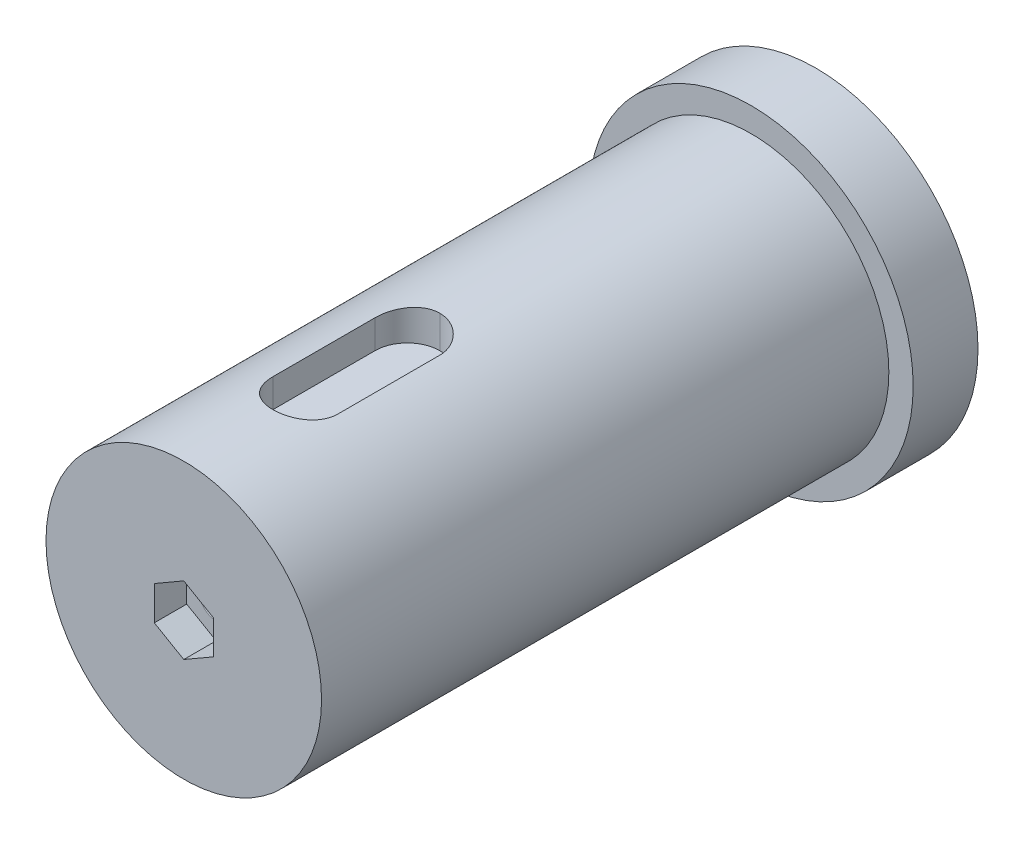
ISO-10303-21;
HEADER;
FILE_DESCRIPTION(('STEP AP214'),'2;1');
FILE_NAME('part.step','',(''),(''),'','','');
FILE_SCHEMA(('AUTOMOTIVE_DESIGN { 1 0 10303 214 1 1 1 1 }'));
ENDSEC;
DATA;
#1=APPLICATION_CONTEXT('core data for automotive mechanical design processes');
#2=APPLICATION_PROTOCOL_DEFINITION('international standard','automotive_design',2000,#1);
#3=PRODUCT_CONTEXT('',#1,'mechanical');
#4=PRODUCT('Part','Part','',(#3));
#5=PRODUCT_RELATED_PRODUCT_CATEGORY('part','',(#4));
#6=PRODUCT_DEFINITION_FORMATION('','',#4);
#7=PRODUCT_DEFINITION_CONTEXT('part definition',#1,'design');
#8=PRODUCT_DEFINITION('design','',#6,#7);
#9=PRODUCT_DEFINITION_SHAPE('','',#8);
#10=(LENGTH_UNIT() NAMED_UNIT(*) SI_UNIT(.MILLI.,.METRE.));
#11=(NAMED_UNIT(*) PLANE_ANGLE_UNIT() SI_UNIT($,.RADIAN.));
#12=(NAMED_UNIT(*) SI_UNIT($,.STERADIAN.) SOLID_ANGLE_UNIT());
#13=UNCERTAINTY_MEASURE_WITH_UNIT(LENGTH_MEASURE(1.E-05),#10,'distance_accuracy_value','');
#14=(GEOMETRIC_REPRESENTATION_CONTEXT(3) GLOBAL_UNCERTAINTY_ASSIGNED_CONTEXT((#13)) GLOBAL_UNIT_ASSIGNED_CONTEXT((#10,
#11,#12)) REPRESENTATION_CONTEXT('',''));
#15=CARTESIAN_POINT('',(0.,0.,0.));
#16=DIRECTION('',(0.,0.,1.));
#17=DIRECTION('',(1.,0.,0.));
#18=AXIS2_PLACEMENT_3D('',#15,#16,#17);
#19=CARTESIAN_POINT('',(0.,0.,35.));
#20=DIRECTION('',(0.,0.,-1.));
#21=DIRECTION('',(-1.,0.,0.));
#22=AXIS2_PLACEMENT_3D('',#19,#20,#21);
#23=CYLINDRICAL_SURFACE('',#22,8.5);
#24=CARTESIAN_POINT('',(-2.,8.26135582092915,31.5));
#25=CARTESIAN_POINT('',(-2.00000055504916,8.26135236320292,31.5554344323461));
#26=CARTESIAN_POINT('',(-1.99769380139236,8.2619144856103,31.6108415088054));
#27=CARTESIAN_POINT('',(-1.98849731170137,8.264134056541,31.7212434339865));
#28=CARTESIAN_POINT('',(-1.98160828133565,8.26579133641032,31.7762383448629));
#29=CARTESIAN_POINT('',(-1.95416393612277,8.27234056234883,31.9397976249519));
#30=CARTESIAN_POINT('',(-1.92683096321235,8.27881027991498,32.0472414713627));
#31=CARTESIAN_POINT('',(-1.85496116677948,8.29520698466521,32.2558503459617));
#32=CARTESIAN_POINT('',(-1.81042483664592,8.30513387269752,32.3570155541235));
#33=CARTESIAN_POINT('',(-1.70546046419011,8.32732086336626,32.5504829517604));
#34=CARTESIAN_POINT('',(-1.6450289846229,8.33958147049888,32.6427832183367));
#35=CARTESIAN_POINT('',(-1.50874637759438,8.36531906602219,32.8176445304476));
#36=CARTESIAN_POINT('',(-1.43264491321001,8.37881352706603,32.9000078464186));
#37=CARTESIAN_POINT('',(-1.26771483694585,8.40534737590744,33.0509339049674));
#38=CARTESIAN_POINT('',(-1.17888421755235,8.41838669151993,33.1194944666046));
#39=CARTESIAN_POINT('',(-0.989672002747235,8.442733227235,33.2416609494937));
#40=CARTESIAN_POINT('',(-0.889162184224323,8.45401726068056,33.2950732925612));
#41=CARTESIAN_POINT('',(-0.68028730939155,8.47338148505523,33.3841696035676));
#42=CARTESIAN_POINT('',(-0.571923680419551,8.48146225642124,33.4198567836348));
#43=CARTESIAN_POINT('',(-0.352485313548645,8.49338596556868,33.4718616310578));
#44=CARTESIAN_POINT('',(-0.241494636223676,8.49730265616028,33.4885167992637));
#45=CARTESIAN_POINT('',(-0.0182275662118472,8.50071323920615,33.5030423420087));
#46=CARTESIAN_POINT('',(0.0940486848647822,8.50020761420044,33.5009147660224));
#47=CARTESIAN_POINT('',(0.314360678706197,8.49488597842209,33.4781814254168));
#48=CARTESIAN_POINT('',(0.422436389839879,8.490154991221,33.4579401327781));
#49=CARTESIAN_POINT('',(0.633611361576777,8.47701221926345,33.4001375163765));
#50=CARTESIAN_POINT('',(0.736710417304357,8.46860028311537,33.3625754802352));
#51=CARTESIAN_POINT('',(0.935993037737944,8.44890733460507,33.2708889810726));
#52=CARTESIAN_POINT('',(1.03211256730711,8.43760323594277,33.2166304990674));
#53=CARTESIAN_POINT('',(1.21400998738322,8.41335915429893,33.0931932832842));
#54=CARTESIAN_POINT('',(1.29978653304345,8.40041895903104,33.0240126125025));
#55=CARTESIAN_POINT('',(1.46072775473717,8.37395331213205,32.870735689924));
#56=CARTESIAN_POINT('',(1.53558950612902,8.36042126513727,32.7863222321905));
#57=CARTESIAN_POINT('',(1.67017505039282,8.33458019092887,32.6059723999822));
#58=CARTESIAN_POINT('',(1.72989470920645,8.32227149826905,32.5100328892058));
#59=CARTESIAN_POINT('',(1.8326691841855,8.30024752435885,32.3087960773831));
#60=CARTESIAN_POINT('',(1.87564929064842,8.29054392828406,32.2034593464437));
#61=CARTESIAN_POINT('',(1.94314531697339,8.27498678101182,31.9868380328643));
#62=CARTESIAN_POINT('',(1.96768876833644,8.26912749076621,31.8755625857552));
#63=CARTESIAN_POINT('',(1.9884132926376,8.26415363873449,31.7194550079354));
#64=CARTESIAN_POINT('',(1.99275932156623,8.26310592036969,31.6756461268753));
#65=CARTESIAN_POINT('',(1.99854927861069,8.2617074132624,31.5878983269988));
#66=CARTESIAN_POINT('',(1.99999797058451,8.26135548050657,31.5439597408004));
#67=CARTESIAN_POINT('',(2.,8.26135582092915,31.5));
#68=B_SPLINE_CURVE_WITH_KNOTS('',3,(#24,#25,#26,#27,#28,#29,#30,#31,#32,#33,#34,#35,#36,#37,#38,
#39,#40,#41,#42,#43,#44,#45,#46,#47,#48,#49,#50,#51,#52,#53,#54,#55,#56,#57,#58,#59,#60,#61,#62,
#63,#64,#65,#66,#67),.UNSPECIFIED.,.F.,.F.,(4,2,2,2,2,2,2,2,2,2,2,2,2,2,2,2,2,2,2,2,2,4),(0.,
0.166198597648887,0.332371606715104,0.663814743733813,0.99524837573467,1.32675373757507,
1.66403554066599,2.00137059509772,2.34283993997873,2.6842473816804,3.01950170621967,
3.35471945001223,3.68334015893414,4.01197438477704,4.34331851400086,4.67470567990143,
5.0140198579258,5.35342657519617,5.69433118783423,6.03472570922611,6.16675483550179,
6.29856669785088),.UNSPECIFIED.);
#69=CARTESIAN_POINT('',(-2.,8.26135582092915,31.5));
#70=VERTEX_POINT('',#69);
#71=CARTESIAN_POINT('',(2.,8.26135582092915,31.5));
#72=VERTEX_POINT('',#71);
#73=EDGE_CURVE('E280',#70,#72,#68,.T.);
#74=ORIENTED_EDGE('',*,*,#73,.F.);
#75=DIRECTION('',(0.,0.,-1.));
#76=VECTOR('',#75,1.);
#77=CARTESIAN_POINT('',(-2.,8.26135582092915,35.));
#78=LINE('',#77,#76);
#79=CARTESIAN_POINT('',(-2.,8.26135582092915,25.2));
#80=VERTEX_POINT('',#79);
#81=EDGE_CURVE('E274',#70,#80,#78,.T.);
#82=ORIENTED_EDGE('',*,*,#81,.T.);
#83=CARTESIAN_POINT('',(-2.,8.26135582092915,25.2));
#84=CARTESIAN_POINT('',(-2.00000055481078,8.26135236234096,25.1445638146387));
#85=CARTESIAN_POINT('',(-1.99769365512001,8.26191452081548,25.0891549847846));
#86=CARTESIAN_POINT('',(-1.98849658529978,8.26413423183047,24.9787495974245));
#87=CARTESIAN_POINT('',(-1.98160712139145,8.26579161558501,24.9237529777129));
#88=CARTESIAN_POINT('',(-1.95416220490535,8.27234097037779,24.7601955672022));
#89=CARTESIAN_POINT('',(-1.92682981263254,8.27881053946126,24.6527552249935));
#90=CARTESIAN_POINT('',(-1.85496170194013,8.29520686552344,24.4441511713702));
#91=CARTESIAN_POINT('',(-1.81042618226286,8.30513358256267,24.3429873874602));
#92=CARTESIAN_POINT('',(-1.70546216079269,8.32732051039671,24.1495197141093));
#93=CARTESIAN_POINT('',(-1.64502976293738,8.33958129302866,24.0572180041965));
#94=CARTESIAN_POINT('',(-1.508747644908,8.36531885769638,23.8823568678266));
#95=CARTESIAN_POINT('',(-1.43264803442737,8.37881308162502,23.7999948297994));
#96=CARTESIAN_POINT('',(-1.26771685263656,8.40534699516044,23.6490681196295));
#97=CARTESIAN_POINT('',(-1.17888287862265,8.41838659841144,23.5805060571313));
#98=CARTESIAN_POINT('',(-0.989647688172531,8.44273662458629,23.4583219459734));
#99=CARTESIAN_POINT('',(-0.889115492968539,8.45402333624081,23.4048978390107));
#100=CARTESIAN_POINT('',(-0.68021441176007,8.47338649943353,23.3158082505194));
#101=CARTESIAN_POINT('',(-0.571851471709626,8.4814653570701,23.2801294537652));
#102=CARTESIAN_POINT('',(-0.385749950023949,8.49157901314195,23.2360194929617));
#103=CARTESIAN_POINT('',(-0.309231901074022,8.49471887929121,23.2225314472355));
#104=CARTESIAN_POINT('',(-0.155155681588706,8.49893711548355,23.2045169857729));
#105=CARTESIAN_POINT('',(-0.0775983952096995,8.5000171381747,23.1999833856257));
#106=CARTESIAN_POINT('',(0.,8.5,23.2));
#107=B_SPLINE_CURVE_WITH_KNOTS('',3,(#83,#84,#85,#86,#87,#88,#89,#90,#91,#92,#93,#94,#95,#96,
#97,#98,#99,#100,#101,#102,#103,#104,#105,#106),.UNSPECIFIED.,.F.,.F.,(4,2,2,2,2,2,2,2,2,2,2,4),
(0.,0.166203852750406,0.332382097679765,0.663814771788094,0.995243617072994,1.32675376589839,
1.66403033417994,2.00137062334601,2.3429373614306,2.68424741616902,2.91701209762429,
3.14958994925359),.UNSPECIFIED.);
#108=CARTESIAN_POINT('',(0.,8.5,23.2));
#109=VERTEX_POINT('',#108);
#110=EDGE_CURVE('E601',#80,#109,#107,.T.);
#111=ORIENTED_EDGE('',*,*,#110,.T.);
#112=CARTESIAN_POINT('',(0.,8.5,23.2));
#113=CARTESIAN_POINT('',(0.0554577177830956,8.50000298855883,23.1999995030463));
#114=CARTESIAN_POINT('',(0.110888151586279,8.49945658717442,23.202308140867));
#115=CARTESIAN_POINT('',(0.221337970644715,8.497296802984,23.2115125100492));
#116=CARTESIAN_POINT('',(0.276357413972367,8.49568357391788,23.2184075804637));
#117=CARTESIAN_POINT('',(0.439991395916461,8.48930268040551,23.245876782209));
#118=CARTESIAN_POINT('',(0.547487078088003,8.48299346551874,23.2732353043088));
#119=CARTESIAN_POINT('',(0.756204960649804,8.46694420606055,23.3451794369051));
#120=CARTESIAN_POINT('',(0.857426954224051,8.45720404845665,23.3897656149718));
#121=CARTESIAN_POINT('',(1.05099104224266,8.43533693314088,23.494848097553));
#122=CARTESIAN_POINT('',(1.14333121189809,8.42320945979847,23.5553478401506));
#123=CARTESIAN_POINT('',(1.3181501151451,8.3976440317271,23.6916990992848));
#124=CARTESIAN_POINT('',(1.40044305664729,8.38418790158618,23.767785312517));
#125=CARTESIAN_POINT('',(1.55123614971488,8.35760381501932,23.9326610461237));
#126=CARTESIAN_POINT('',(1.619733350118,8.34447592933583,24.0214532776148));
#127=CARTESIAN_POINT('',(1.74184693943837,8.31985060969153,24.2106490764957));
#128=CARTESIAN_POINT('',(1.79525416276162,8.30837708034302,24.3111908884767));
#129=CARTESIAN_POINT('',(1.88430913042451,8.28863511914758,24.5201109245299));
#130=CARTESIAN_POINT('',(1.91997068491663,8.28036419606278,24.6284829794391));
#131=CARTESIAN_POINT('',(1.96403435943009,8.27000058789428,24.8145375464282));
#132=CARTESIAN_POINT('',(1.97750168238921,8.26677902264792,24.8909955819783));
#133=CARTESIAN_POINT('',(1.99548948288383,8.26244785871754,25.0449557333138));
#134=CARTESIAN_POINT('',(2.00001672996872,8.26133666205758,25.1224570143309));
#135=CARTESIAN_POINT('',(2.,8.26135582092915,25.2));
#136=B_SPLINE_CURVE_WITH_KNOTS('',3,(#112,#113,#114,#115,#116,#117,#118,#119,#120,#121,#122,
#123,#124,#125,#126,#127,#128,#129,#130,#131,#132,#133,#134,#135),.UNSPECIFIED.,.F.,.F.,(4,2,2,
2,2,2,2,2,2,2,2,4),(0.,0.1662686484185,0.332513341183918,0.664098160325054,0.995693904556593,
1.32736134808833,1.66444828413272,2.00160725285015,2.34323295798394,2.6845923834696,
2.9171790790428,3.14958958910976),.UNSPECIFIED.);
#137=CARTESIAN_POINT('',(2.,8.26135582092915,25.2));
#138=VERTEX_POINT('',#137);
#139=EDGE_CURVE('E593',#109,#138,#136,.T.);
#140=ORIENTED_EDGE('',*,*,#139,.T.);
#141=DIRECTION('',(0.,0.,-1.));
#142=VECTOR('',#141,1.);
#143=CARTESIAN_POINT('',(2.,8.26135582092915,35.));
#144=LINE('',#143,#142);
#145=EDGE_CURVE('E278',#138,#72,#144,.F.);
#146=ORIENTED_EDGE('',*,*,#145,.T.);
#147=EDGE_LOOP('',(#74,#82,#111,#140,#146));
#148=FACE_BOUND('',#147,.T.);
#149=CARTESIAN_POINT('',(0.,0.,4.));
#150=DIRECTION('',(0.,0.,1.));
#151=DIRECTION('',(1.,0.,0.));
#152=AXIS2_PLACEMENT_3D('',#149,#150,#151);
#153=CIRCLE('',#152,8.5);
#154=CARTESIAN_POINT('',(8.5,0.,4.));
#155=VERTEX_POINT('',#154);
#156=EDGE_CURVE('E252',#155,#155,#153,.T.);
#157=ORIENTED_EDGE('',*,*,#156,.T.);
#158=EDGE_LOOP('',(#157));
#159=FACE_BOUND('',#158,.T.);
#160=CARTESIAN_POINT('',(0.,0.,39.));
#161=DIRECTION('',(0.,0.,1.));
#162=DIRECTION('',(1.,0.,0.));
#163=AXIS2_PLACEMENT_3D('',#160,#161,#162);
#164=CIRCLE('',#163,8.5);
#165=CARTESIAN_POINT('',(8.5,0.,39.));
#166=VERTEX_POINT('',#165);
#167=EDGE_CURVE('E240',#166,#166,#164,.T.);
#168=ORIENTED_EDGE('',*,*,#167,.F.);
#169=EDGE_LOOP('',(#168));
#170=FACE_BOUND('',#169,.T.);
#171=ADVANCED_FACE('F58',(#148,#159,#170),#23,.T.);
#172=CARTESIAN_POINT('',(-2.,6.5,21.));
#173=DIRECTION('',(0.,-1.,0.));
#174=DIRECTION('',(0.,0.,-1.));
#175=AXIS2_PLACEMENT_3D('',#172,#173,#174);
#176=PLANE('',#175);
#177=CARTESIAN_POINT('',(0.,6.5,25.2));
#178=DIRECTION('',(0.,-1.,0.));
#179=DIRECTION('',(0.,0.,-1.));
#180=AXIS2_PLACEMENT_3D('',#177,#178,#179);
#181=CIRCLE('',#180,2.);
#182=CARTESIAN_POINT('',(2.,6.5,25.2));
#183=VERTEX_POINT('',#182);
#184=CARTESIAN_POINT('',(0.,6.5,23.2));
#185=VERTEX_POINT('',#184);
#186=EDGE_CURVE('E289',#183,#185,#181,.F.);
#187=ORIENTED_EDGE('',*,*,#186,.T.);
#188=CARTESIAN_POINT('',(0.,6.5,25.2));
#189=DIRECTION('',(0.,-1.,0.));
#190=DIRECTION('',(0.,0.,-1.));
#191=AXIS2_PLACEMENT_3D('',#188,#189,#190);
#192=CIRCLE('',#191,2.);
#193=CARTESIAN_POINT('',(-2.,6.5,25.2));
#194=VERTEX_POINT('',#193);
#195=EDGE_CURVE('E619',#185,#194,#192,.F.);
#196=ORIENTED_EDGE('',*,*,#195,.T.);
#197=DIRECTION('',(0.,0.,1.));
#198=VECTOR('',#197,1.);
#199=CARTESIAN_POINT('',(-2.,6.5,21.));
#200=LINE('',#199,#198);
#201=CARTESIAN_POINT('',(-2.,6.5,31.5));
#202=VERTEX_POINT('',#201);
#203=EDGE_CURVE('E271',#194,#202,#200,.T.);
#204=ORIENTED_EDGE('',*,*,#203,.T.);
#205=CARTESIAN_POINT('',(0.,6.5,31.5));
#206=DIRECTION('',(0.,1.,0.));
#207=DIRECTION('',(0.,0.,1.));
#208=AXIS2_PLACEMENT_3D('',#205,#206,#207);
#209=CIRCLE('',#208,2.);
#210=CARTESIAN_POINT('',(2.,6.5,31.5));
#211=VERTEX_POINT('',#210);
#212=EDGE_CURVE('E259',#202,#211,#209,.T.);
#213=ORIENTED_EDGE('',*,*,#212,.T.);
#214=DIRECTION('',(0.,0.,1.));
#215=VECTOR('',#214,1.);
#216=CARTESIAN_POINT('',(2.,6.5,21.));
#217=LINE('',#216,#215);
#218=EDGE_CURVE('E272',#183,#211,#217,.T.);
#219=ORIENTED_EDGE('',*,*,#218,.F.);
#220=EDGE_LOOP('',(#187,#196,#204,#213,#219));
#221=FACE_BOUND('',#220,.T.);
#222=ADVANCED_FACE('F310',(#221),#176,.F.);
#223=CARTESIAN_POINT('',(2.,10.5,21.));
#224=DIRECTION('',(1.,0.,0.));
#225=DIRECTION('',(0.,1.,0.));
#226=AXIS2_PLACEMENT_3D('',#223,#224,#225);
#227=PLANE('',#226);
#228=ORIENTED_EDGE('',*,*,#145,.F.);
#229=DIRECTION('',(0.,-1.,0.));
#230=VECTOR('',#229,1.);
#231=CARTESIAN_POINT('',(2.,6.5,25.2));
#232=LINE('',#231,#230);
#233=EDGE_CURVE('E622',#138,#183,#232,.T.);
#234=ORIENTED_EDGE('',*,*,#233,.T.);
#235=ORIENTED_EDGE('',*,*,#218,.T.);
#236=DIRECTION('',(0.,-1.,0.));
#237=VECTOR('',#236,1.);
#238=CARTESIAN_POINT('',(2.,10.,31.5));
#239=LINE('',#238,#237);
#240=EDGE_CURVE('E262',#72,#211,#239,.T.);
#241=ORIENTED_EDGE('',*,*,#240,.F.);
#242=EDGE_LOOP('',(#228,#234,#235,#241));
#243=FACE_BOUND('',#242,.T.);
#244=ADVANCED_FACE('F313',(#243),#227,.F.);
#245=CARTESIAN_POINT('',(-2.,10.5,21.));
#246=DIRECTION('',(-1.,0.,0.));
#247=DIRECTION('',(0.,-1.,0.));
#248=AXIS2_PLACEMENT_3D('',#245,#246,#247);
#249=PLANE('',#248);
#250=ORIENTED_EDGE('',*,*,#203,.F.);
#251=DIRECTION('',(0.,-1.,0.));
#252=VECTOR('',#251,1.);
#253=CARTESIAN_POINT('',(-2.,8.26135582092915,25.2));
#254=LINE('',#253,#252);
#255=EDGE_CURVE('E629',#194,#80,#254,.F.);
#256=ORIENTED_EDGE('',*,*,#255,.T.);
#257=ORIENTED_EDGE('',*,*,#81,.F.);
#258=DIRECTION('',(0.,-1.,0.));
#259=VECTOR('',#258,1.);
#260=CARTESIAN_POINT('',(-2.,10.,31.5));
#261=LINE('',#260,#259);
#262=EDGE_CURVE('E265',#70,#202,#261,.T.);
#263=ORIENTED_EDGE('',*,*,#262,.T.);
#264=EDGE_LOOP('',(#250,#256,#257,#263));
#265=FACE_BOUND('',#264,.T.);
#266=ADVANCED_FACE('F300',(#265),#249,.F.);
#267=CARTESIAN_POINT('',(0.,10.,31.5));
#268=DIRECTION('',(0.,-1.,0.));
#269=DIRECTION('',(0.,0.,-1.));
#270=AXIS2_PLACEMENT_3D('',#267,#268,#269);
#271=CYLINDRICAL_SURFACE('',#270,2.);
#272=ORIENTED_EDGE('',*,*,#73,.T.);
#273=ORIENTED_EDGE('',*,*,#240,.T.);
#274=ORIENTED_EDGE('',*,*,#212,.F.);
#275=ORIENTED_EDGE('',*,*,#262,.F.);
#276=EDGE_LOOP('',(#272,#273,#274,#275));
#277=FACE_BOUND('',#276,.T.);
#278=ADVANCED_FACE('F294',(#277),#271,.F.);
#279=CARTESIAN_POINT('',(0.,10.5,25.2));
#280=DIRECTION('',(0.,1.,0.));
#281=DIRECTION('',(-1.,0.,0.));
#282=AXIS2_PLACEMENT_3D('',#279,#280,#281);
#283=CYLINDRICAL_SURFACE('',#282,2.);
#284=ORIENTED_EDGE('',*,*,#233,.F.);
#285=ORIENTED_EDGE('',*,*,#139,.F.);
#286=DIRECTION('',(0.,-1.,0.));
#287=VECTOR('',#286,1.);
#288=CARTESIAN_POINT('',(0.,8.26135582092915,23.2));
#289=LINE('',#288,#287);
#290=EDGE_CURVE('E258',#185,#109,#289,.F.);
#291=ORIENTED_EDGE('',*,*,#290,.F.);
#292=ORIENTED_EDGE('',*,*,#186,.F.);
#293=EDGE_LOOP('',(#284,#285,#291,#292));
#294=FACE_BOUND('',#293,.T.);
#295=ADVANCED_FACE('F299',(#294),#283,.F.);
#296=CARTESIAN_POINT('',(0.,10.001,25.2));
#297=DIRECTION('',(0.,1.,0.));
#298=DIRECTION('',(-1.,0.,0.));
#299=AXIS2_PLACEMENT_3D('',#296,#297,#298);
#300=CYLINDRICAL_SURFACE('',#299,2.);
#301=ORIENTED_EDGE('',*,*,#110,.F.);
#302=ORIENTED_EDGE('',*,*,#255,.F.);
#303=ORIENTED_EDGE('',*,*,#195,.F.);
#304=ORIENTED_EDGE('',*,*,#290,.T.);
#305=EDGE_LOOP('',(#301,#302,#303,#304));
#306=FACE_BOUND('',#305,.T.);
#307=ADVANCED_FACE('F327',(#306),#300,.F.);
#308=CARTESIAN_POINT('',(0.,0.,4.));
#309=DIRECTION('',(0.,0.,1.));
#310=DIRECTION('',(1.,0.,0.));
#311=AXIS2_PLACEMENT_3D('',#308,#309,#310);
#312=PLANE('',#311);
#313=ORIENTED_EDGE('',*,*,#156,.F.);
#314=EDGE_LOOP('',(#313));
#315=FACE_BOUND('',#314,.T.);
#316=CARTESIAN_POINT('',(0.,0.,4.));
#317=DIRECTION('',(0.,0.,1.));
#318=DIRECTION('',(1.,0.,0.));
#319=AXIS2_PLACEMENT_3D('',#316,#317,#318);
#320=CIRCLE('',#319,10.);
#321=CARTESIAN_POINT('',(10.,0.,4.));
#322=VERTEX_POINT('',#321);
#323=EDGE_CURVE('E255',#322,#322,#320,.T.);
#324=ORIENTED_EDGE('',*,*,#323,.T.);
#325=EDGE_LOOP('',(#324));
#326=FACE_BOUND('',#325,.T.);
#327=ADVANCED_FACE('F302',(#315,#326),#312,.T.);
#328=CARTESIAN_POINT('',(0.,0.,0.));
#329=DIRECTION('',(0.,0.,1.));
#330=DIRECTION('',(1.,0.,0.));
#331=AXIS2_PLACEMENT_3D('',#328,#329,#330);
#332=PLANE('',#331);
#333=DIRECTION('',(-1.,0.,0.));
#334=VECTOR('',#333,1.);
#335=CARTESIAN_POINT('',(-4.,-4.,0.));
#336=LINE('',#335,#334);
#337=CARTESIAN_POINT('',(4.,-4.,0.));
#338=VERTEX_POINT('',#337);
#339=CARTESIAN_POINT('',(-4.,-4.,0.));
#340=VERTEX_POINT('',#339);
#341=EDGE_CURVE('E194',#338,#340,#336,.T.);
#342=ORIENTED_EDGE('',*,*,#341,.F.);
#343=DIRECTION('',(0.,-1.,0.));
#344=VECTOR('',#343,1.);
#345=CARTESIAN_POINT('',(4.,-4.,0.));
#346=LINE('',#345,#344);
#347=CARTESIAN_POINT('',(4.,4.,0.));
#348=VERTEX_POINT('',#347);
#349=EDGE_CURVE('E73',#348,#338,#346,.T.);
#350=ORIENTED_EDGE('',*,*,#349,.F.);
#351=DIRECTION('',(1.,0.,0.));
#352=VECTOR('',#351,1.);
#353=CARTESIAN_POINT('',(-4.,4.,0.));
#354=LINE('',#353,#352);
#355=CARTESIAN_POINT('',(-4.,4.,0.));
#356=VERTEX_POINT('',#355);
#357=EDGE_CURVE('E185',#356,#348,#354,.T.);
#358=ORIENTED_EDGE('',*,*,#357,.F.);
#359=DIRECTION('',(0.,1.,0.));
#360=VECTOR('',#359,1.);
#361=CARTESIAN_POINT('',(-4.,-4.,0.));
#362=LINE('',#361,#360);
#363=EDGE_CURVE('E188',#340,#356,#362,.T.);
#364=ORIENTED_EDGE('',*,*,#363,.F.);
#365=EDGE_LOOP('',(#342,#350,#358,#364));
#366=FACE_BOUND('',#365,.T.);
#367=CARTESIAN_POINT('',(0.,0.,0.));
#368=DIRECTION('',(0.,0.,-1.));
#369=DIRECTION('',(-1.,0.,0.));
#370=AXIS2_PLACEMENT_3D('',#367,#368,#369);
#371=CIRCLE('',#370,10.);
#372=CARTESIAN_POINT('',(-10.,0.,0.));
#373=VERTEX_POINT('',#372);
#374=EDGE_CURVE('E268',#373,#373,#371,.T.);
#375=ORIENTED_EDGE('',*,*,#374,.T.);
#376=EDGE_LOOP('',(#375));
#377=FACE_BOUND('',#376,.T.);
#378=ADVANCED_FACE('F308',(#366,#377),#332,.F.);
#379=CARTESIAN_POINT('',(0.,0.,7.));
#380=DIRECTION('',(0.,0.,-1.));
#381=DIRECTION('',(-1.,0.,0.));
#382=AXIS2_PLACEMENT_3D('',#379,#380,#381);
#383=CYLINDRICAL_SURFACE('',#382,10.);
#384=ORIENTED_EDGE('',*,*,#374,.F.);
#385=EDGE_LOOP('',(#384));
#386=FACE_BOUND('',#385,.T.);
#387=ORIENTED_EDGE('',*,*,#323,.F.);
#388=EDGE_LOOP('',(#387));
#389=FACE_BOUND('',#388,.T.);
#390=ADVANCED_FACE('F304',(#386,#389),#383,.T.);
#391=CARTESIAN_POINT('',(0.,0.,39.));
#392=DIRECTION('',(0.,0.,1.));
#393=DIRECTION('',(1.,0.,0.));
#394=AXIS2_PLACEMENT_3D('',#391,#392,#393);
#395=PLANE('',#394);
#396=DIRECTION('',(-0.866025403784439,0.5,0.));
#397=VECTOR('',#396,1.);
#398=CARTESIAN_POINT('',(1.81865334794732,1.05,39.));
#399=LINE('',#398,#397);
#400=CARTESIAN_POINT('',(1.81865334794732,1.05,39.));
#401=VERTEX_POINT('',#400);
#402=CARTESIAN_POINT('',(0.,2.1,39.));
#403=VERTEX_POINT('',#402);
#404=EDGE_CURVE('E81',#401,#403,#399,.T.);
#405=ORIENTED_EDGE('',*,*,#404,.F.);
#406=DIRECTION('',(0.,1.,0.));
#407=VECTOR('',#406,1.);
#408=CARTESIAN_POINT('',(1.81865334794732,-1.05,39.));
#409=LINE('',#408,#407);
#410=CARTESIAN_POINT('',(1.81865334794732,-1.05,39.));
#411=VERTEX_POINT('',#410);
#412=EDGE_CURVE('E207',#411,#401,#409,.T.);
#413=ORIENTED_EDGE('',*,*,#412,.F.);
#414=DIRECTION('',(0.866025403784439,0.5,0.));
#415=VECTOR('',#414,1.);
#416=CARTESIAN_POINT('',(0.,-2.1,39.));
#417=LINE('',#416,#415);
#418=CARTESIAN_POINT('',(0.,-2.1,39.));
#419=VERTEX_POINT('',#418);
#420=EDGE_CURVE('E233',#419,#411,#417,.T.);
#421=ORIENTED_EDGE('',*,*,#420,.F.);
#422=DIRECTION('',(0.866025403784439,-0.5,0.));
#423=VECTOR('',#422,1.);
#424=CARTESIAN_POINT('',(-1.81865334794732,-1.05,39.));
#425=LINE('',#424,#423);
#426=CARTESIAN_POINT('',(-1.81865334794732,-1.05,39.));
#427=VERTEX_POINT('',#426);
#428=EDGE_CURVE('E230',#427,#419,#425,.T.);
#429=ORIENTED_EDGE('',*,*,#428,.F.);
#430=DIRECTION('',(0.,-1.,0.));
#431=VECTOR('',#430,1.);
#432=CARTESIAN_POINT('',(-1.81865334794732,1.05,39.));
#433=LINE('',#432,#431);
#434=CARTESIAN_POINT('',(-1.81865334794732,1.05,39.));
#435=VERTEX_POINT('',#434);
#436=EDGE_CURVE('E227',#435,#427,#433,.T.);
#437=ORIENTED_EDGE('',*,*,#436,.F.);
#438=DIRECTION('',(-0.866025403784438,-0.5,0.));
#439=VECTOR('',#438,1.);
#440=CARTESIAN_POINT('',(0.,2.1,39.));
#441=LINE('',#440,#439);
#442=EDGE_CURVE('E224',#403,#435,#441,.T.);
#443=ORIENTED_EDGE('',*,*,#442,.F.);
#444=EDGE_LOOP('',(#405,#413,#421,#429,#437,#443));
#445=FACE_BOUND('',#444,.T.);
#446=ORIENTED_EDGE('',*,*,#167,.T.);
#447=EDGE_LOOP('',(#446));
#448=FACE_BOUND('',#447,.T.);
#449=ADVANCED_FACE('F307',(#445,#448),#395,.T.);
#450=CARTESIAN_POINT('',(0.,0.,37.));
#451=DIRECTION('',(0.,0.,1.));
#452=DIRECTION('',(1.,0.,0.));
#453=AXIS2_PLACEMENT_3D('',#450,#451,#452);
#454=PLANE('',#453);
#455=CARTESIAN_POINT('',(0.,0.,37.));
#456=DIRECTION('',(0.,0.,1.));
#457=DIRECTION('',(1.,0.,0.));
#458=AXIS2_PLACEMENT_3D('',#455,#456,#457);
#459=CIRCLE('',#458,1.05);
#460=CARTESIAN_POINT('',(1.05,0.,37.));
#461=VERTEX_POINT('',#460);
#462=EDGE_CURVE('E12',#461,#461,#459,.F.);
#463=ORIENTED_EDGE('',*,*,#462,.T.);
#464=EDGE_LOOP('',(#463));
#465=FACE_BOUND('',#464,.T.);
#466=DIRECTION('',(-0.866025403784439,0.5,0.));
#467=VECTOR('',#466,1.);
#468=CARTESIAN_POINT('',(1.81865334794732,1.05,37.));
#469=LINE('',#468,#467);
#470=CARTESIAN_POINT('',(1.81865334794732,1.05,37.));
#471=VERTEX_POINT('',#470);
#472=CARTESIAN_POINT('',(0.,2.1,37.));
#473=VERTEX_POINT('',#472);
#474=EDGE_CURVE('E203',#471,#473,#469,.T.);
#475=ORIENTED_EDGE('',*,*,#474,.T.);
#476=DIRECTION('',(-0.866025403784438,-0.5,0.));
#477=VECTOR('',#476,1.);
#478=CARTESIAN_POINT('',(0.,2.1,37.));
#479=LINE('',#478,#477);
#480=CARTESIAN_POINT('',(-1.81865334794732,1.05,37.));
#481=VERTEX_POINT('',#480);
#482=EDGE_CURVE('E206',#473,#481,#479,.T.);
#483=ORIENTED_EDGE('',*,*,#482,.T.);
#484=DIRECTION('',(0.,-1.,0.));
#485=VECTOR('',#484,1.);
#486=CARTESIAN_POINT('',(-1.81865334794732,1.05,37.));
#487=LINE('',#486,#485);
#488=CARTESIAN_POINT('',(-1.81865334794732,-1.05,37.));
#489=VERTEX_POINT('',#488);
#490=EDGE_CURVE('E210',#481,#489,#487,.T.);
#491=ORIENTED_EDGE('',*,*,#490,.T.);
#492=DIRECTION('',(0.866025403784439,-0.5,0.));
#493=VECTOR('',#492,1.);
#494=CARTESIAN_POINT('',(-1.81865334794732,-1.05,37.));
#495=LINE('',#494,#493);
#496=CARTESIAN_POINT('',(0.,-2.1,37.));
#497=VERTEX_POINT('',#496);
#498=EDGE_CURVE('E213',#489,#497,#495,.T.);
#499=ORIENTED_EDGE('',*,*,#498,.T.);
#500=DIRECTION('',(0.866025403784439,0.5,0.));
#501=VECTOR('',#500,1.);
#502=CARTESIAN_POINT('',(0.,-2.1,37.));
#503=LINE('',#502,#501);
#504=CARTESIAN_POINT('',(1.81865334794732,-1.05,37.));
#505=VERTEX_POINT('',#504);
#506=EDGE_CURVE('E216',#497,#505,#503,.T.);
#507=ORIENTED_EDGE('',*,*,#506,.T.);
#508=DIRECTION('',(0.,1.,0.));
#509=VECTOR('',#508,1.);
#510=CARTESIAN_POINT('',(1.81865334794732,-1.05,37.));
#511=LINE('',#510,#509);
#512=EDGE_CURVE('E219',#505,#471,#511,.T.);
#513=ORIENTED_EDGE('',*,*,#512,.T.);
#514=EDGE_LOOP('',(#475,#483,#491,#499,#507,#513));
#515=FACE_BOUND('',#514,.T.);
#516=ADVANCED_FACE('F342',(#465,#515),#454,.T.);
#517=CARTESIAN_POINT('',(1.81865334794732,1.05,37.));
#518=DIRECTION('',(0.5,0.866025403784439,0.));
#519=DIRECTION('',(-0.866025403784439,0.5,0.));
#520=AXIS2_PLACEMENT_3D('',#517,#518,#519);
#521=PLANE('',#520);
#522=ORIENTED_EDGE('',*,*,#404,.T.);
#523=DIRECTION('',(0.,0.,1.));
#524=VECTOR('',#523,1.);
#525=CARTESIAN_POINT('',(0.,2.1,37.));
#526=LINE('',#525,#524);
#527=EDGE_CURVE('E222',#473,#403,#526,.T.);
#528=ORIENTED_EDGE('',*,*,#527,.F.);
#529=ORIENTED_EDGE('',*,*,#474,.F.);
#530=DIRECTION('',(0.,0.,1.));
#531=VECTOR('',#530,1.);
#532=CARTESIAN_POINT('',(1.81865334794732,1.05,37.));
#533=LINE('',#532,#531);
#534=EDGE_CURVE('E238',#471,#401,#533,.T.);
#535=ORIENTED_EDGE('',*,*,#534,.T.);
#536=EDGE_LOOP('',(#522,#528,#529,#535));
#537=FACE_BOUND('',#536,.T.);
#538=ADVANCED_FACE('F347',(#537),#521,.F.);
#539=CARTESIAN_POINT('',(1.81865334794732,-1.05,37.));
#540=DIRECTION('',(1.,0.,0.));
#541=DIRECTION('',(0.,1.,0.));
#542=AXIS2_PLACEMENT_3D('',#539,#540,#541);
#543=PLANE('',#542);
#544=ORIENTED_EDGE('',*,*,#412,.T.);
#545=ORIENTED_EDGE('',*,*,#534,.F.);
#546=ORIENTED_EDGE('',*,*,#512,.F.);
#547=DIRECTION('',(0.,0.,1.));
#548=VECTOR('',#547,1.);
#549=CARTESIAN_POINT('',(1.81865334794732,-1.05,37.));
#550=LINE('',#549,#548);
#551=EDGE_CURVE('E241',#505,#411,#550,.T.);
#552=ORIENTED_EDGE('',*,*,#551,.T.);
#553=EDGE_LOOP('',(#544,#545,#546,#552));
#554=FACE_BOUND('',#553,.T.);
#555=ADVANCED_FACE('F358',(#554),#543,.F.);
#556=CARTESIAN_POINT('',(0.,-2.1,37.));
#557=DIRECTION('',(0.5,-0.866025403784439,0.));
#558=DIRECTION('',(0.866025403784439,0.5,0.));
#559=AXIS2_PLACEMENT_3D('',#556,#557,#558);
#560=PLANE('',#559);
#561=ORIENTED_EDGE('',*,*,#420,.T.);
#562=ORIENTED_EDGE('',*,*,#551,.F.);
#563=ORIENTED_EDGE('',*,*,#506,.F.);
#564=DIRECTION('',(0.,0.,1.));
#565=VECTOR('',#564,1.);
#566=CARTESIAN_POINT('',(0.,-2.1,37.));
#567=LINE('',#566,#565);
#568=EDGE_CURVE('E243',#497,#419,#567,.T.);
#569=ORIENTED_EDGE('',*,*,#568,.T.);
#570=EDGE_LOOP('',(#561,#562,#563,#569));
#571=FACE_BOUND('',#570,.T.);
#572=ADVANCED_FACE('F370',(#571),#560,.F.);
#573=CARTESIAN_POINT('',(-1.81865334794732,-1.05,37.));
#574=DIRECTION('',(-0.5,-0.866025403784439,0.));
#575=DIRECTION('',(0.866025403784439,-0.5,0.));
#576=AXIS2_PLACEMENT_3D('',#573,#574,#575);
#577=PLANE('',#576);
#578=ORIENTED_EDGE('',*,*,#428,.T.);
#579=ORIENTED_EDGE('',*,*,#568,.F.);
#580=ORIENTED_EDGE('',*,*,#498,.F.);
#581=DIRECTION('',(0.,0.,1.));
#582=VECTOR('',#581,1.);
#583=CARTESIAN_POINT('',(-1.81865334794732,-1.05,37.));
#584=LINE('',#583,#582);
#585=EDGE_CURVE('E245',#489,#427,#584,.T.);
#586=ORIENTED_EDGE('',*,*,#585,.T.);
#587=EDGE_LOOP('',(#578,#579,#580,#586));
#588=FACE_BOUND('',#587,.T.);
#589=ADVANCED_FACE('F366',(#588),#577,.F.);
#590=CARTESIAN_POINT('',(-1.81865334794732,1.05,37.));
#591=DIRECTION('',(-1.,0.,0.));
#592=DIRECTION('',(0.,-1.,0.));
#593=AXIS2_PLACEMENT_3D('',#590,#591,#592);
#594=PLANE('',#593);
#595=ORIENTED_EDGE('',*,*,#436,.T.);
#596=ORIENTED_EDGE('',*,*,#585,.F.);
#597=ORIENTED_EDGE('',*,*,#490,.F.);
#598=DIRECTION('',(0.,0.,1.));
#599=VECTOR('',#598,1.);
#600=CARTESIAN_POINT('',(-1.81865334794732,1.05,37.));
#601=LINE('',#600,#599);
#602=EDGE_CURVE('E247',#481,#435,#601,.T.);
#603=ORIENTED_EDGE('',*,*,#602,.T.);
#604=EDGE_LOOP('',(#595,#596,#597,#603));
#605=FACE_BOUND('',#604,.T.);
#606=ADVANCED_FACE('F362',(#605),#594,.F.);
#607=CARTESIAN_POINT('',(0.,2.1,37.));
#608=DIRECTION('',(-0.5,0.866025403784439,0.));
#609=DIRECTION('',(-0.866025403784438,-0.5,0.));
#610=AXIS2_PLACEMENT_3D('',#607,#608,#609);
#611=PLANE('',#610);
#612=ORIENTED_EDGE('',*,*,#442,.T.);
#613=ORIENTED_EDGE('',*,*,#602,.F.);
#614=ORIENTED_EDGE('',*,*,#482,.F.);
#615=ORIENTED_EDGE('',*,*,#527,.T.);
#616=EDGE_LOOP('',(#612,#613,#614,#615));
#617=FACE_BOUND('',#616,.T.);
#618=ADVANCED_FACE('F359',(#617),#611,.F.);
#619=CARTESIAN_POINT('',(0.,0.,39.8284271247462));
#620=DIRECTION('',(0.,0.,-1.));
#621=DIRECTION('',(-1.,0.,0.));
#622=AXIS2_PLACEMENT_3D('',#619,#620,#621);
#623=CYLINDRICAL_SURFACE('',#622,0.85);
#624=CARTESIAN_POINT('',(0.,0.,36.8));
#625=DIRECTION('',(0.,0.,1.));
#626=DIRECTION('',(1.,0.,0.));
#627=AXIS2_PLACEMENT_3D('',#624,#625,#626);
#628=CIRCLE('',#627,0.85);
#629=CARTESIAN_POINT('',(0.85,0.,36.8));
#630=VERTEX_POINT('',#629);
#631=EDGE_CURVE('E66',#630,#630,#628,.T.);
#632=ORIENTED_EDGE('',*,*,#631,.T.);
#633=EDGE_LOOP('',(#632));
#634=FACE_BOUND('',#633,.T.);
#635=CARTESIAN_POINT('',(0.,0.,34.));
#636=DIRECTION('',(0.,0.,1.));
#637=DIRECTION('',(1.,0.,0.));
#638=AXIS2_PLACEMENT_3D('',#635,#636,#637);
#639=CIRCLE('',#638,0.85);
#640=CARTESIAN_POINT('',(0.85,0.,34.));
#641=VERTEX_POINT('',#640);
#642=EDGE_CURVE('E600',#641,#641,#639,.F.);
#643=ORIENTED_EDGE('',*,*,#642,.T.);
#644=EDGE_LOOP('',(#643));
#645=FACE_BOUND('',#644,.T.);
#646=ADVANCED_FACE('F354',(#634,#645),#623,.F.);
#647=CARTESIAN_POINT('',(0.,0.,34.));
#648=DIRECTION('',(0.,0.,1.));
#649=DIRECTION('',(1.,0.,0.));
#650=AXIS2_PLACEMENT_3D('',#647,#648,#649);
#651=PLANE('',#650);
#652=ORIENTED_EDGE('',*,*,#642,.F.);
#653=EDGE_LOOP('',(#652));
#654=FACE_BOUND('',#653,.T.);
#655=ADVANCED_FACE('F351',(#654),#651,.T.);
#656=CARTESIAN_POINT('',(0.,0.,36.8));
#657=DIRECTION('',(0.,0.,1.));
#658=DIRECTION('',(1.,0.,0.));
#659=AXIS2_PLACEMENT_3D('',#656,#657,#658);
#660=TOROIDAL_SURFACE('',#659,1.05,0.2);
#661=ORIENTED_EDGE('',*,*,#462,.F.);
#662=EDGE_LOOP('',(#661));
#663=FACE_BOUND('',#662,.T.);
#664=ORIENTED_EDGE('',*,*,#631,.F.);
#665=EDGE_LOOP('',(#664));
#666=FACE_BOUND('',#665,.T.);
#667=ADVANCED_FACE('F60',(#663,#666),#660,.T.);
#668=CARTESIAN_POINT('',(4.,-4.,6.));
#669=DIRECTION('',(1.,0.,0.));
#670=DIRECTION('',(0.,0.,-1.));
#671=AXIS2_PLACEMENT_3D('',#668,#669,#670);
#672=PLANE('',#671);
#673=ORIENTED_EDGE('',*,*,#349,.T.);
#674=DIRECTION('',(0.,0.,-1.));
#675=VECTOR('',#674,1.);
#676=CARTESIAN_POINT('',(4.,-4.,6.));
#677=LINE('',#676,#675);
#678=CARTESIAN_POINT('',(4.,-4.,6.));
#679=VERTEX_POINT('',#678);
#680=EDGE_CURVE('E163',#679,#338,#677,.T.);
#681=ORIENTED_EDGE('',*,*,#680,.F.);
#682=DIRECTION('',(0.,-1.,0.));
#683=VECTOR('',#682,1.);
#684=CARTESIAN_POINT('',(4.,-4.,6.));
#685=LINE('',#684,#683);
#686=CARTESIAN_POINT('',(4.,4.,6.));
#687=VERTEX_POINT('',#686);
#688=EDGE_CURVE('E167',#687,#679,#685,.T.);
#689=ORIENTED_EDGE('',*,*,#688,.F.);
#690=DIRECTION('',(0.,0.,-1.));
#691=VECTOR('',#690,1.);
#692=CARTESIAN_POINT('',(4.,4.,6.));
#693=LINE('',#692,#691);
#694=EDGE_CURVE('E198',#687,#348,#693,.T.);
#695=ORIENTED_EDGE('',*,*,#694,.T.);
#696=EDGE_LOOP('',(#673,#681,#689,#695));
#697=FACE_BOUND('',#696,.T.);
#698=ADVANCED_FACE('F165',(#697),#672,.F.);
#699=CARTESIAN_POINT('',(-4.,4.,6.));
#700=DIRECTION('',(0.,1.,0.));
#701=DIRECTION('',(-1.,0.,0.));
#702=AXIS2_PLACEMENT_3D('',#699,#700,#701);
#703=PLANE('',#702);
#704=ORIENTED_EDGE('',*,*,#357,.T.);
#705=ORIENTED_EDGE('',*,*,#694,.F.);
#706=DIRECTION('',(1.,0.,0.));
#707=VECTOR('',#706,1.);
#708=CARTESIAN_POINT('',(-4.,4.,6.));
#709=LINE('',#708,#707);
#710=CARTESIAN_POINT('',(-4.,4.,6.));
#711=VERTEX_POINT('',#710);
#712=EDGE_CURVE('E173',#711,#687,#709,.T.);
#713=ORIENTED_EDGE('',*,*,#712,.F.);
#714=DIRECTION('',(0.,0.,-1.));
#715=VECTOR('',#714,1.);
#716=CARTESIAN_POINT('',(-4.,4.,6.));
#717=LINE('',#716,#715);
#718=EDGE_CURVE('E200',#711,#356,#717,.T.);
#719=ORIENTED_EDGE('',*,*,#718,.T.);
#720=EDGE_LOOP('',(#704,#705,#713,#719));
#721=FACE_BOUND('',#720,.T.);
#722=ADVANCED_FACE('F383',(#721),#703,.F.);
#723=CARTESIAN_POINT('',(-4.,-4.,6.));
#724=DIRECTION('',(-1.,0.,0.));
#725=DIRECTION('',(0.,0.,1.));
#726=AXIS2_PLACEMENT_3D('',#723,#724,#725);
#727=PLANE('',#726);
#728=ORIENTED_EDGE('',*,*,#363,.T.);
#729=ORIENTED_EDGE('',*,*,#718,.F.);
#730=DIRECTION('',(0.,1.,0.));
#731=VECTOR('',#730,1.);
#732=CARTESIAN_POINT('',(-4.,-4.,6.));
#733=LINE('',#732,#731);
#734=CARTESIAN_POINT('',(-4.,-4.,6.));
#735=VERTEX_POINT('',#734);
#736=EDGE_CURVE('E181',#735,#711,#733,.T.);
#737=ORIENTED_EDGE('',*,*,#736,.F.);
#738=DIRECTION('',(0.,0.,-1.));
#739=VECTOR('',#738,1.);
#740=CARTESIAN_POINT('',(-4.,-4.,6.));
#741=LINE('',#740,#739);
#742=EDGE_CURVE('E172',#735,#340,#741,.T.);
#743=ORIENTED_EDGE('',*,*,#742,.T.);
#744=EDGE_LOOP('',(#728,#729,#737,#743));
#745=FACE_BOUND('',#744,.T.);
#746=ADVANCED_FACE('F386',(#745),#727,.F.);
#747=CARTESIAN_POINT('',(-4.,-4.,6.));
#748=DIRECTION('',(0.,-1.,0.));
#749=DIRECTION('',(1.,0.,0.));
#750=AXIS2_PLACEMENT_3D('',#747,#748,#749);
#751=PLANE('',#750);
#752=ORIENTED_EDGE('',*,*,#341,.T.);
#753=ORIENTED_EDGE('',*,*,#742,.F.);
#754=DIRECTION('',(-1.,0.,0.));
#755=VECTOR('',#754,1.);
#756=CARTESIAN_POINT('',(-4.,-4.,6.));
#757=LINE('',#756,#755);
#758=EDGE_CURVE('E176',#679,#735,#757,.T.);
#759=ORIENTED_EDGE('',*,*,#758,.F.);
#760=ORIENTED_EDGE('',*,*,#680,.T.);
#761=EDGE_LOOP('',(#752,#753,#759,#760));
#762=FACE_BOUND('',#761,.T.);
#763=ADVANCED_FACE('F177',(#762),#751,.F.);
#764=CARTESIAN_POINT('',(0.,0.,6.));
#765=DIRECTION('',(0.,0.,-1.));
#766=DIRECTION('',(-1.,0.,0.));
#767=AXIS2_PLACEMENT_3D('',#764,#765,#766);
#768=PLANE('',#767);
#769=ORIENTED_EDGE('',*,*,#688,.T.);
#770=ORIENTED_EDGE('',*,*,#758,.T.);
#771=ORIENTED_EDGE('',*,*,#736,.T.);
#772=ORIENTED_EDGE('',*,*,#712,.T.);
#773=EDGE_LOOP('',(#769,#770,#771,#772));
#774=FACE_BOUND('',#773,.T.);
#775=ADVANCED_FACE('F183',(#774),#768,.T.);
#776=CLOSED_SHELL('',(#171,#222,#244,#266,#278,#295,#307,#327,#378,#390,#449,#516,#538,#555,
#572,#589,#606,#618,#646,#655,#667,#698,#722,#746,#763,#775));
#777=MANIFOLD_SOLID_BREP('B2',#776);
#778=ADVANCED_BREP_SHAPE_REPRESENTATION('',(#18,#777),#14);
#779=SHAPE_DEFINITION_REPRESENTATION(#9,#778);
ENDSEC;
END-ISO-10303-21;
